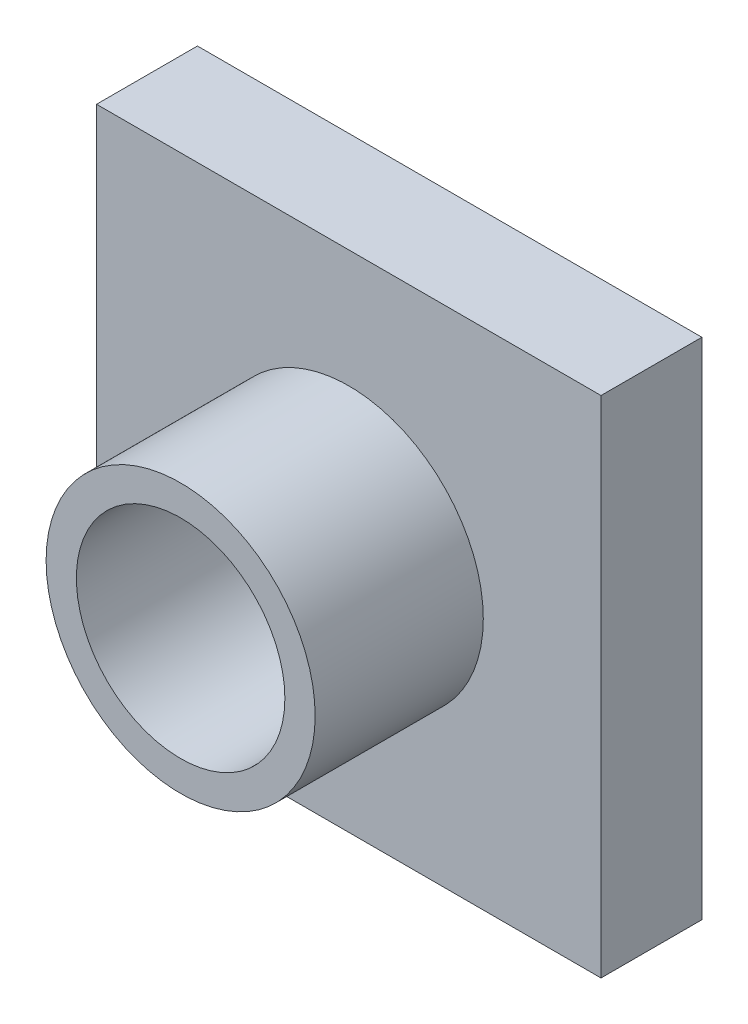
ISO-10303-21;
HEADER;
FILE_DESCRIPTION(('STEP AP214'),'2;1');
FILE_NAME('part.step','',(''),(''),'','','');
FILE_SCHEMA(('AUTOMOTIVE_DESIGN { 1 0 10303 214 1 1 1 1 }'));
ENDSEC;
DATA;
#1=APPLICATION_CONTEXT('core data for automotive mechanical design processes');
#2=APPLICATION_PROTOCOL_DEFINITION('international standard','automotive_design',2000,#1);
#3=PRODUCT_CONTEXT('',#1,'mechanical');
#4=PRODUCT('Part','Part','',(#3));
#5=PRODUCT_RELATED_PRODUCT_CATEGORY('part','',(#4));
#6=PRODUCT_DEFINITION_FORMATION('','',#4);
#7=PRODUCT_DEFINITION_CONTEXT('part definition',#1,'design');
#8=PRODUCT_DEFINITION('design','',#6,#7);
#9=PRODUCT_DEFINITION_SHAPE('','',#8);
#10=(LENGTH_UNIT() NAMED_UNIT(*) SI_UNIT(.MILLI.,.METRE.));
#11=(NAMED_UNIT(*) PLANE_ANGLE_UNIT() SI_UNIT($,.RADIAN.));
#12=(NAMED_UNIT(*) SI_UNIT($,.STERADIAN.) SOLID_ANGLE_UNIT());
#13=UNCERTAINTY_MEASURE_WITH_UNIT(LENGTH_MEASURE(1.E-05),#10,'distance_accuracy_value','');
#14=(GEOMETRIC_REPRESENTATION_CONTEXT(3) GLOBAL_UNCERTAINTY_ASSIGNED_CONTEXT((#13)) GLOBAL_UNIT_ASSIGNED_CONTEXT((#10,
#11,#12)) REPRESENTATION_CONTEXT('',''));
#15=CARTESIAN_POINT('',(0.,0.,0.));
#16=DIRECTION('',(0.,0.,1.));
#17=DIRECTION('',(1.,0.,0.));
#18=AXIS2_PLACEMENT_3D('',#15,#16,#17);
#19=CARTESIAN_POINT('',(-7.5,-7.5,3.));
#20=DIRECTION('',(-1.,0.,0.));
#21=DIRECTION('',(0.,0.,1.));
#22=AXIS2_PLACEMENT_3D('',#19,#20,#21);
#23=PLANE('',#22);
#24=DIRECTION('',(0.,1.,0.));
#25=VECTOR('',#24,1.);
#26=CARTESIAN_POINT('',(-7.5,-7.5,0.));
#27=LINE('',#26,#25);
#28=CARTESIAN_POINT('',(-7.5,-7.5,0.));
#29=VERTEX_POINT('',#28);
#30=CARTESIAN_POINT('',(-7.5,7.5,0.));
#31=VERTEX_POINT('',#30);
#32=EDGE_CURVE('E118',#29,#31,#27,.T.);
#33=ORIENTED_EDGE('',*,*,#32,.F.);
#34=DIRECTION('',(0.,0.,-1.));
#35=VECTOR('',#34,1.);
#36=CARTESIAN_POINT('',(-7.5,-7.5,3.));
#37=LINE('',#36,#35);
#38=CARTESIAN_POINT('',(-7.5,-7.5,3.));
#39=VERTEX_POINT('',#38);
#40=EDGE_CURVE('E55',#39,#29,#37,.T.);
#41=ORIENTED_EDGE('',*,*,#40,.F.);
#42=DIRECTION('',(0.,1.,0.));
#43=VECTOR('',#42,1.);
#44=CARTESIAN_POINT('',(-7.5,-7.5,3.));
#45=LINE('',#44,#43);
#46=CARTESIAN_POINT('',(-7.5,7.5,3.));
#47=VERTEX_POINT('',#46);
#48=EDGE_CURVE('E111',#39,#47,#45,.T.);
#49=ORIENTED_EDGE('',*,*,#48,.T.);
#50=DIRECTION('',(0.,0.,-1.));
#51=VECTOR('',#50,1.);
#52=CARTESIAN_POINT('',(-7.5,7.5,3.));
#53=LINE('',#52,#51);
#54=EDGE_CURVE('E48',#47,#31,#53,.T.);
#55=ORIENTED_EDGE('',*,*,#54,.T.);
#56=EDGE_LOOP('',(#33,#41,#49,#55));
#57=FACE_BOUND('',#56,.T.);
#58=ADVANCED_FACE('F45',(#57),#23,.T.);
#59=CARTESIAN_POINT('',(-7.5,-7.5,3.));
#60=DIRECTION('',(0.,1.,0.));
#61=DIRECTION('',(0.,0.,1.));
#62=AXIS2_PLACEMENT_3D('',#59,#60,#61);
#63=PLANE('',#62);
#64=DIRECTION('',(1.,0.,0.));
#65=VECTOR('',#64,1.);
#66=CARTESIAN_POINT('',(-7.5,-7.5,0.));
#67=LINE('',#66,#65);
#68=CARTESIAN_POINT('',(7.5,-7.5,0.));
#69=VERTEX_POINT('',#68);
#70=EDGE_CURVE('E80',#29,#69,#67,.T.);
#71=ORIENTED_EDGE('',*,*,#70,.T.);
#72=DIRECTION('',(0.,0.,-1.));
#73=VECTOR('',#72,1.);
#74=CARTESIAN_POINT('',(7.5,-7.5,3.));
#75=LINE('',#74,#73);
#76=CARTESIAN_POINT('',(7.5,-7.5,3.));
#77=VERTEX_POINT('',#76);
#78=EDGE_CURVE('E108',#77,#69,#75,.T.);
#79=ORIENTED_EDGE('',*,*,#78,.F.);
#80=DIRECTION('',(1.,0.,0.));
#81=VECTOR('',#80,1.);
#82=CARTESIAN_POINT('',(-7.5,-7.5,3.));
#83=LINE('',#82,#81);
#84=EDGE_CURVE('E97',#39,#77,#83,.T.);
#85=ORIENTED_EDGE('',*,*,#84,.F.);
#86=ORIENTED_EDGE('',*,*,#40,.T.);
#87=EDGE_LOOP('',(#71,#79,#85,#86));
#88=FACE_BOUND('',#87,.T.);
#89=ADVANCED_FACE('F137',(#88),#63,.F.);
#90=CARTESIAN_POINT('',(7.5,-7.5,3.));
#91=DIRECTION('',(-1.,0.,0.));
#92=DIRECTION('',(0.,0.,1.));
#93=AXIS2_PLACEMENT_3D('',#90,#91,#92);
#94=PLANE('',#93);
#95=DIRECTION('',(0.,1.,0.));
#96=VECTOR('',#95,1.);
#97=CARTESIAN_POINT('',(7.5,-7.5,0.));
#98=LINE('',#97,#96);
#99=CARTESIAN_POINT('',(7.5,7.5,0.));
#100=VERTEX_POINT('',#99);
#101=EDGE_CURVE('E105',#69,#100,#98,.T.);
#102=ORIENTED_EDGE('',*,*,#101,.T.);
#103=DIRECTION('',(0.,0.,-1.));
#104=VECTOR('',#103,1.);
#105=CARTESIAN_POINT('',(7.5,7.5,3.));
#106=LINE('',#105,#104);
#107=CARTESIAN_POINT('',(7.5,7.5,3.));
#108=VERTEX_POINT('',#107);
#109=EDGE_CURVE('E102',#108,#100,#106,.T.);
#110=ORIENTED_EDGE('',*,*,#109,.F.);
#111=DIRECTION('',(0.,1.,0.));
#112=VECTOR('',#111,1.);
#113=CARTESIAN_POINT('',(7.5,-7.5,3.));
#114=LINE('',#113,#112);
#115=EDGE_CURVE('E92',#77,#108,#114,.T.);
#116=ORIENTED_EDGE('',*,*,#115,.F.);
#117=ORIENTED_EDGE('',*,*,#78,.T.);
#118=EDGE_LOOP('',(#102,#110,#116,#117));
#119=FACE_BOUND('',#118,.T.);
#120=ADVANCED_FACE('F103',(#119),#94,.F.);
#121=CARTESIAN_POINT('',(-7.5,7.5,3.));
#122=DIRECTION('',(0.,1.,0.));
#123=DIRECTION('',(0.,0.,1.));
#124=AXIS2_PLACEMENT_3D('',#121,#122,#123);
#125=PLANE('',#124);
#126=DIRECTION('',(1.,0.,0.));
#127=VECTOR('',#126,1.);
#128=CARTESIAN_POINT('',(-7.5,7.5,0.));
#129=LINE('',#128,#127);
#130=EDGE_CURVE('E122',#31,#100,#129,.T.);
#131=ORIENTED_EDGE('',*,*,#130,.F.);
#132=ORIENTED_EDGE('',*,*,#54,.F.);
#133=DIRECTION('',(1.,0.,0.));
#134=VECTOR('',#133,1.);
#135=CARTESIAN_POINT('',(-7.5,7.5,3.));
#136=LINE('',#135,#134);
#137=EDGE_CURVE('E96',#47,#108,#136,.T.);
#138=ORIENTED_EDGE('',*,*,#137,.T.);
#139=ORIENTED_EDGE('',*,*,#109,.T.);
#140=EDGE_LOOP('',(#131,#132,#138,#139));
#141=FACE_BOUND('',#140,.T.);
#142=ADVANCED_FACE('F109',(#141),#125,.T.);
#143=CARTESIAN_POINT('',(0.,0.,3.));
#144=DIRECTION('',(0.,0.,-1.));
#145=DIRECTION('',(-1.,0.,0.));
#146=AXIS2_PLACEMENT_3D('',#143,#144,#145);
#147=PLANE('',#146);
#148=CARTESIAN_POINT('',(0.,0.,3.));
#149=DIRECTION('',(0.,0.,1.));
#150=DIRECTION('',(1.,0.,0.));
#151=AXIS2_PLACEMENT_3D('',#148,#149,#150);
#152=CIRCLE('',#151,4.);
#153=CARTESIAN_POINT('',(4.,0.,3.));
#154=VERTEX_POINT('',#153);
#155=EDGE_CURVE('E11',#154,#154,#152,.T.);
#156=ORIENTED_EDGE('',*,*,#155,.F.);
#157=EDGE_LOOP('',(#156));
#158=FACE_BOUND('',#157,.T.);
#159=ORIENTED_EDGE('',*,*,#48,.F.);
#160=ORIENTED_EDGE('',*,*,#84,.T.);
#161=ORIENTED_EDGE('',*,*,#115,.T.);
#162=ORIENTED_EDGE('',*,*,#137,.F.);
#163=EDGE_LOOP('',(#159,#160,#161,#162));
#164=FACE_BOUND('',#163,.T.);
#165=ADVANCED_FACE('F95',(#158,#164),#147,.F.);
#166=CARTESIAN_POINT('',(0.,0.,0.));
#167=DIRECTION('',(0.,0.,-1.));
#168=DIRECTION('',(-1.,0.,0.));
#169=AXIS2_PLACEMENT_3D('',#166,#167,#168);
#170=PLANE('',#169);
#171=ORIENTED_EDGE('',*,*,#32,.T.);
#172=ORIENTED_EDGE('',*,*,#130,.T.);
#173=ORIENTED_EDGE('',*,*,#101,.F.);
#174=ORIENTED_EDGE('',*,*,#70,.F.);
#175=EDGE_LOOP('',(#171,#172,#173,#174));
#176=FACE_BOUND('',#175,.T.);
#177=ADVANCED_FACE('F134',(#176),#170,.T.);
#178=CARTESIAN_POINT('',(0.,0.,8.));
#179=DIRECTION('',(0.,0.,-1.));
#180=DIRECTION('',(-1.,0.,0.));
#181=AXIS2_PLACEMENT_3D('',#178,#179,#180);
#182=CYLINDRICAL_SURFACE('',#181,4.);
#183=CARTESIAN_POINT('',(0.,0.,8.));
#184=DIRECTION('',(0.,0.,1.));
#185=DIRECTION('',(1.,0.,0.));
#186=AXIS2_PLACEMENT_3D('',#183,#184,#185);
#187=CIRCLE('',#186,4.);
#188=CARTESIAN_POINT('',(4.,0.,8.));
#189=VERTEX_POINT('',#188);
#190=EDGE_CURVE('E123',#189,#189,#187,.T.);
#191=ORIENTED_EDGE('',*,*,#190,.F.);
#192=EDGE_LOOP('',(#191));
#193=FACE_BOUND('',#192,.T.);
#194=ORIENTED_EDGE('',*,*,#155,.T.);
#195=EDGE_LOOP('',(#194));
#196=FACE_BOUND('',#195,.T.);
#197=ADVANCED_FACE('F157',(#193,#196),#182,.T.);
#198=CARTESIAN_POINT('',(0.,0.,8.));
#199=DIRECTION('',(0.,0.,1.));
#200=DIRECTION('',(1.,0.,0.));
#201=AXIS2_PLACEMENT_3D('',#198,#199,#200);
#202=PLANE('',#201);
#203=CARTESIAN_POINT('',(0.,0.,8.));
#204=DIRECTION('',(0.,0.,1.));
#205=DIRECTION('',(1.,0.,0.));
#206=AXIS2_PLACEMENT_3D('',#203,#204,#205);
#207=CIRCLE('',#206,3.1);
#208=CARTESIAN_POINT('',(3.1,0.,8.));
#209=VERTEX_POINT('',#208);
#210=EDGE_CURVE('E179',#209,#209,#207,.T.);
#211=ORIENTED_EDGE('',*,*,#210,.F.);
#212=EDGE_LOOP('',(#211));
#213=FACE_BOUND('',#212,.T.);
#214=ORIENTED_EDGE('',*,*,#190,.T.);
#215=EDGE_LOOP('',(#214));
#216=FACE_BOUND('',#215,.T.);
#217=ADVANCED_FACE('F161',(#213,#216),#202,.T.);
#218=CARTESIAN_POINT('',(0.,0.,3.5));
#219=DIRECTION('',(0.,0.,1.));
#220=DIRECTION('',(1.,0.,0.));
#221=AXIS2_PLACEMENT_3D('',#218,#219,#220);
#222=CYLINDRICAL_SURFACE('',#221,3.1);
#223=CARTESIAN_POINT('',(0.,0.,3.5));
#224=DIRECTION('',(0.,0.,1.));
#225=DIRECTION('',(1.,0.,0.));
#226=AXIS2_PLACEMENT_3D('',#223,#224,#225);
#227=CIRCLE('',#226,3.1);
#228=CARTESIAN_POINT('',(3.1,0.,3.5));
#229=VERTEX_POINT('',#228);
#230=EDGE_CURVE('E177',#229,#229,#227,.T.);
#231=ORIENTED_EDGE('',*,*,#230,.F.);
#232=EDGE_LOOP('',(#231));
#233=FACE_BOUND('',#232,.T.);
#234=ORIENTED_EDGE('',*,*,#210,.T.);
#235=EDGE_LOOP('',(#234));
#236=FACE_BOUND('',#235,.T.);
#237=ADVANCED_FACE('F165',(#233,#236),#222,.F.);
#238=CARTESIAN_POINT('',(0.,0.,3.5));
#239=DIRECTION('',(0.,0.,1.));
#240=DIRECTION('',(1.,0.,0.));
#241=AXIS2_PLACEMENT_3D('',#238,#239,#240);
#242=PLANE('',#241);
#243=ORIENTED_EDGE('',*,*,#230,.T.);
#244=EDGE_LOOP('',(#243));
#245=FACE_BOUND('',#244,.T.);
#246=ADVANCED_FACE('F169',(#245),#242,.T.);
#247=CLOSED_SHELL('',(#58,#89,#120,#142,#165,#177,#197,#217,#237,#246));
#248=MANIFOLD_SOLID_BREP('B2',#247);
#249=ADVANCED_BREP_SHAPE_REPRESENTATION('',(#18,#248),#14);
#250=SHAPE_DEFINITION_REPRESENTATION(#9,#249);
ENDSEC;
END-ISO-10303-21;
